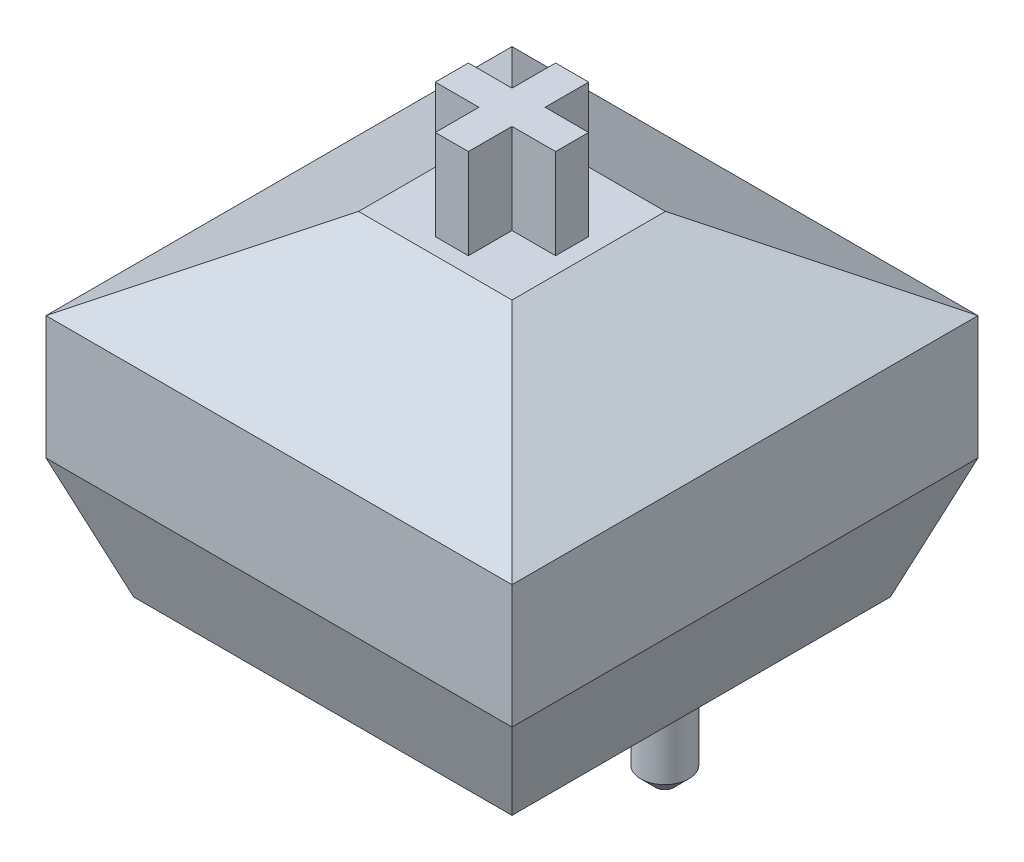
ISO-10303-21;
HEADER;
FILE_DESCRIPTION(('STEP AP214'),'2;1');
FILE_NAME('part.step','',(''),(''),'','','');
FILE_SCHEMA(('AUTOMOTIVE_DESIGN { 1 0 10303 214 1 1 1 1 }'));
ENDSEC;
DATA;
#1=APPLICATION_CONTEXT('core data for automotive mechanical design processes');
#2=APPLICATION_PROTOCOL_DEFINITION('international standard','automotive_design',2000,#1);
#3=PRODUCT_CONTEXT('',#1,'mechanical');
#4=PRODUCT('Part','Part','',(#3));
#5=PRODUCT_RELATED_PRODUCT_CATEGORY('part','',(#4));
#6=PRODUCT_DEFINITION_FORMATION('','',#4);
#7=PRODUCT_DEFINITION_CONTEXT('part definition',#1,'design');
#8=PRODUCT_DEFINITION('design','',#6,#7);
#9=PRODUCT_DEFINITION_SHAPE('','',#8);
#10=(LENGTH_UNIT() NAMED_UNIT(*) SI_UNIT(.MILLI.,.METRE.));
#11=(NAMED_UNIT(*) PLANE_ANGLE_UNIT() SI_UNIT($,.RADIAN.));
#12=(NAMED_UNIT(*) SI_UNIT($,.STERADIAN.) SOLID_ANGLE_UNIT());
#13=UNCERTAINTY_MEASURE_WITH_UNIT(LENGTH_MEASURE(1.E-05),#10,'distance_accuracy_value','');
#14=(GEOMETRIC_REPRESENTATION_CONTEXT(3) GLOBAL_UNCERTAINTY_ASSIGNED_CONTEXT((#13)) GLOBAL_UNIT_ASSIGNED_CONTEXT((#10,
#11,#12)) REPRESENTATION_CONTEXT('',''));
#15=CARTESIAN_POINT('',(0.,0.,0.));
#16=DIRECTION('',(0.,0.,1.));
#17=DIRECTION('',(1.,0.,0.));
#18=AXIS2_PLACEMENT_3D('',#15,#16,#17);
#19=CARTESIAN_POINT('',(0.,11.1,0.));
#20=DIRECTION('',(0.,1.,0.));
#21=DIRECTION('',(0.,0.,1.));
#22=AXIS2_PLACEMENT_3D('',#19,#20,#21);
#23=PLANE('',#22);
#24=DIRECTION('',(0.,0.,-1.));
#25=VECTOR('',#24,1.);
#26=CARTESIAN_POINT('',(2.55084757729337,11.1,-7.747));
#27=LINE('',#26,#25);
#28=CARTESIAN_POINT('',(2.55084757729337,11.1,2.55084757729337));
#29=VERTEX_POINT('',#28);
#30=CARTESIAN_POINT('',(2.55084757729337,11.1,-2.55084757729337));
#31=VERTEX_POINT('',#30);
#32=EDGE_CURVE('E240',#29,#31,#27,.T.);
#33=ORIENTED_EDGE('',*,*,#32,.T.);
#34=DIRECTION('',(-1.,0.,0.));
#35=VECTOR('',#34,1.);
#36=CARTESIAN_POINT('',(-7.747,11.1,-2.55084757729337));
#37=LINE('',#36,#35);
#38=CARTESIAN_POINT('',(-2.55084757729338,11.1,-2.55084757729337));
#39=VERTEX_POINT('',#38);
#40=EDGE_CURVE('E242',#31,#39,#37,.T.);
#41=ORIENTED_EDGE('',*,*,#40,.T.);
#42=DIRECTION('',(0.,0.,1.));
#43=VECTOR('',#42,1.);
#44=CARTESIAN_POINT('',(-2.55084757729338,11.1,7.747));
#45=LINE('',#44,#43);
#46=CARTESIAN_POINT('',(-2.55084757729338,11.1,2.55084757729337));
#47=VERTEX_POINT('',#46);
#48=EDGE_CURVE('E236',#39,#47,#45,.T.);
#49=ORIENTED_EDGE('',*,*,#48,.T.);
#50=DIRECTION('',(1.,0.,0.));
#51=VECTOR('',#50,1.);
#52=CARTESIAN_POINT('',(7.747,11.1,2.55084757729337));
#53=LINE('',#52,#51);
#54=EDGE_CURVE('E238',#47,#29,#53,.T.);
#55=ORIENTED_EDGE('',*,*,#54,.T.);
#56=EDGE_LOOP('',(#33,#41,#49,#55));
#57=FACE_BOUND('',#56,.T.);
#58=DIRECTION('',(1.,0.,0.));
#59=VECTOR('',#58,1.);
#60=CARTESIAN_POINT('',(2.,11.1,0.55));
#61=LINE('',#60,#59);
#62=CARTESIAN_POINT('',(0.55,11.1,0.55));
#63=VERTEX_POINT('',#62);
#64=CARTESIAN_POINT('',(2.,11.1,0.55));
#65=VERTEX_POINT('',#64);
#66=EDGE_CURVE('E756',#63,#65,#61,.T.);
#67=ORIENTED_EDGE('',*,*,#66,.F.);
#68=DIRECTION('',(0.,0.,-1.));
#69=VECTOR('',#68,1.);
#70=CARTESIAN_POINT('',(0.55,11.1,0.55));
#71=LINE('',#70,#69);
#72=CARTESIAN_POINT('',(0.55,11.1,2.));
#73=VERTEX_POINT('',#72);
#74=EDGE_CURVE('E199',#73,#63,#71,.T.);
#75=ORIENTED_EDGE('',*,*,#74,.F.);
#76=DIRECTION('',(1.,0.,0.));
#77=VECTOR('',#76,1.);
#78=CARTESIAN_POINT('',(-0.55,11.1,2.));
#79=LINE('',#78,#77);
#80=CARTESIAN_POINT('',(-0.55,11.1,2.));
#81=VERTEX_POINT('',#80);
#82=EDGE_CURVE('E195',#81,#73,#79,.T.);
#83=ORIENTED_EDGE('',*,*,#82,.F.);
#84=DIRECTION('',(0.,0.,1.));
#85=VECTOR('',#84,1.);
#86=CARTESIAN_POINT('',(-0.55,11.1,0.55));
#87=LINE('',#86,#85);
#88=CARTESIAN_POINT('',(-0.55,11.1,0.55));
#89=VERTEX_POINT('',#88);
#90=EDGE_CURVE('E779',#89,#81,#87,.T.);
#91=ORIENTED_EDGE('',*,*,#90,.F.);
#92=DIRECTION('',(1.,0.,0.));
#93=VECTOR('',#92,1.);
#94=CARTESIAN_POINT('',(-0.55,11.1,0.55));
#95=LINE('',#94,#93);
#96=CARTESIAN_POINT('',(-2.,11.1,0.55));
#97=VERTEX_POINT('',#96);
#98=EDGE_CURVE('E777',#97,#89,#95,.T.);
#99=ORIENTED_EDGE('',*,*,#98,.F.);
#100=DIRECTION('',(0.,0.,1.));
#101=VECTOR('',#100,1.);
#102=CARTESIAN_POINT('',(-2.,11.1,-0.55));
#103=LINE('',#102,#101);
#104=CARTESIAN_POINT('',(-2.,11.1,-0.55));
#105=VERTEX_POINT('',#104);
#106=EDGE_CURVE('E775',#105,#97,#103,.T.);
#107=ORIENTED_EDGE('',*,*,#106,.F.);
#108=DIRECTION('',(-1.,0.,0.));
#109=VECTOR('',#108,1.);
#110=CARTESIAN_POINT('',(-0.55,11.1,-0.55));
#111=LINE('',#110,#109);
#112=CARTESIAN_POINT('',(-0.55,11.1,-0.55));
#113=VERTEX_POINT('',#112);
#114=EDGE_CURVE('E773',#113,#105,#111,.T.);
#115=ORIENTED_EDGE('',*,*,#114,.F.);
#116=DIRECTION('',(0.,0.,1.));
#117=VECTOR('',#116,1.);
#118=CARTESIAN_POINT('',(-0.55,11.1,-2.));
#119=LINE('',#118,#117);
#120=CARTESIAN_POINT('',(-0.55,11.1,-2.));
#121=VERTEX_POINT('',#120);
#122=EDGE_CURVE('E771',#121,#113,#119,.T.);
#123=ORIENTED_EDGE('',*,*,#122,.F.);
#124=DIRECTION('',(-1.,0.,0.));
#125=VECTOR('',#124,1.);
#126=CARTESIAN_POINT('',(-0.55,11.1,-2.));
#127=LINE('',#126,#125);
#128=CARTESIAN_POINT('',(0.55,11.1,-2.));
#129=VERTEX_POINT('',#128);
#130=EDGE_CURVE('E766',#129,#121,#127,.T.);
#131=ORIENTED_EDGE('',*,*,#130,.F.);
#132=DIRECTION('',(0.,0.,-1.));
#133=VECTOR('',#132,1.);
#134=CARTESIAN_POINT('',(0.55,11.1,-2.));
#135=LINE('',#134,#133);
#136=CARTESIAN_POINT('',(0.55,11.1,-0.55));
#137=VERTEX_POINT('',#136);
#138=EDGE_CURVE('E764',#137,#129,#135,.T.);
#139=ORIENTED_EDGE('',*,*,#138,.F.);
#140=DIRECTION('',(-1.,0.,0.));
#141=VECTOR('',#140,1.);
#142=CARTESIAN_POINT('',(2.,11.1,-0.55));
#143=LINE('',#142,#141);
#144=CARTESIAN_POINT('',(2.,11.1,-0.55));
#145=VERTEX_POINT('',#144);
#146=EDGE_CURVE('E755',#145,#137,#143,.T.);
#147=ORIENTED_EDGE('',*,*,#146,.F.);
#148=DIRECTION('',(0.,0.,-1.));
#149=VECTOR('',#148,1.);
#150=CARTESIAN_POINT('',(2.,11.1,-0.55));
#151=LINE('',#150,#149);
#152=EDGE_CURVE('E751',#65,#145,#151,.T.);
#153=ORIENTED_EDGE('',*,*,#152,.F.);
#154=EDGE_LOOP('',(#67,#75,#83,#91,#99,#107,#115,#123,#131,#139,#147,#153));
#155=FACE_BOUND('',#154,.T.);
#156=ADVANCED_FACE('F35',(#57,#155),#23,.T.);
#157=CARTESIAN_POINT('',(0.,-2.8,0.));
#158=DIRECTION('',(0.,1.,0.));
#159=DIRECTION('',(0.,0.,1.));
#160=AXIS2_PLACEMENT_3D('',#157,#158,#159);
#161=CYLINDRICAL_SURFACE('',#160,1.9);
#162=CARTESIAN_POINT('',(0.,-2.3,0.));
#163=DIRECTION('',(0.,1.,0.));
#164=DIRECTION('',(0.,0.,1.));
#165=AXIS2_PLACEMENT_3D('',#162,#163,#164);
#166=CIRCLE('',#165,1.9);
#167=CARTESIAN_POINT('',(0.,-2.3,1.9));
#168=VERTEX_POINT('',#167);
#169=EDGE_CURVE('E281',#168,#168,#166,.T.);
#170=ORIENTED_EDGE('',*,*,#169,.T.);
#171=EDGE_LOOP('',(#170));
#172=FACE_BOUND('',#171,.T.);
#173=CARTESIAN_POINT('',(0.,0.,0.));
#174=DIRECTION('',(0.,1.,0.));
#175=DIRECTION('',(0.,0.,1.));
#176=AXIS2_PLACEMENT_3D('',#173,#174,#175);
#177=CIRCLE('',#176,1.9);
#178=CARTESIAN_POINT('',(0.,0.,1.9));
#179=VERTEX_POINT('',#178);
#180=EDGE_CURVE('E233',#179,#179,#177,.T.);
#181=ORIENTED_EDGE('',*,*,#180,.F.);
#182=EDGE_LOOP('',(#181));
#183=FACE_BOUND('',#182,.T.);
#184=ADVANCED_FACE('F317',(#172,#183),#161,.T.);
#185=CARTESIAN_POINT('',(0.,-2.8,0.));
#186=DIRECTION('',(0.,1.,0.));
#187=DIRECTION('',(0.,0.,1.));
#188=AXIS2_PLACEMENT_3D('',#185,#186,#187);
#189=PLANE('',#188);
#190=CARTESIAN_POINT('',(0.,-2.8,0.));
#191=DIRECTION('',(0.,1.,0.));
#192=DIRECTION('',(0.,0.,1.));
#193=AXIS2_PLACEMENT_3D('',#190,#191,#192);
#194=CIRCLE('',#193,1.39999999999999);
#195=CARTESIAN_POINT('',(0.,-2.8,1.39999999999999));
#196=VERTEX_POINT('',#195);
#197=EDGE_CURVE('E293',#196,#196,#194,.F.);
#198=ORIENTED_EDGE('',*,*,#197,.T.);
#199=EDGE_LOOP('',(#198));
#200=FACE_BOUND('',#199,.T.);
#201=ADVANCED_FACE('F323',(#200),#189,.F.);
#202=CARTESIAN_POINT('',(-7.747,11.1,7.747));
#203=DIRECTION('',(1.,0.,0.));
#204=DIRECTION('',(0.,0.,-1.));
#205=AXIS2_PLACEMENT_3D('',#202,#203,#204);
#206=PLANE('',#205);
#207=DIRECTION('',(0.,-1.,0.));
#208=VECTOR('',#207,1.);
#209=CARTESIAN_POINT('',(-7.747,11.1,-7.747));
#210=LINE('',#209,#208);
#211=CARTESIAN_POINT('',(-7.747,8.09999999999999,-7.747));
#212=VERTEX_POINT('',#211);
#213=CARTESIAN_POINT('',(-7.747,4.00000000000003,-7.747));
#214=VERTEX_POINT('',#213);
#215=EDGE_CURVE('E224',#212,#214,#210,.T.);
#216=ORIENTED_EDGE('',*,*,#215,.T.);
#217=DIRECTION('',(0.,0.,1.));
#218=VECTOR('',#217,1.);
#219=CARTESIAN_POINT('',(-7.747,4.00000000000003,7.747));
#220=LINE('',#219,#218);
#221=CARTESIAN_POINT('',(-7.747,4.00000000000003,7.747));
#222=VERTEX_POINT('',#221);
#223=EDGE_CURVE('E254',#214,#222,#220,.T.);
#224=ORIENTED_EDGE('',*,*,#223,.T.);
#225=DIRECTION('',(0.,-1.,0.));
#226=VECTOR('',#225,1.);
#227=CARTESIAN_POINT('',(-7.747,11.1,7.747));
#228=LINE('',#227,#226);
#229=CARTESIAN_POINT('',(-7.747,8.09999999999999,7.747));
#230=VERTEX_POINT('',#229);
#231=EDGE_CURVE('E231',#230,#222,#228,.T.);
#232=ORIENTED_EDGE('',*,*,#231,.F.);
#233=DIRECTION('',(0.,0.,-1.));
#234=VECTOR('',#233,1.);
#235=CARTESIAN_POINT('',(-7.747,8.09999999999999,-7.747));
#236=LINE('',#235,#234);
#237=EDGE_CURVE('E252',#230,#212,#236,.T.);
#238=ORIENTED_EDGE('',*,*,#237,.T.);
#239=EDGE_LOOP('',(#216,#224,#232,#238));
#240=FACE_BOUND('',#239,.T.);
#241=ADVANCED_FACE('F344',(#240),#206,.F.);
#242=CARTESIAN_POINT('',(7.747,11.1,7.747));
#243=DIRECTION('',(0.,0.,-1.));
#244=DIRECTION('',(-1.,0.,0.));
#245=AXIS2_PLACEMENT_3D('',#242,#243,#244);
#246=PLANE('',#245);
#247=ORIENTED_EDGE('',*,*,#231,.T.);
#248=DIRECTION('',(1.,0.,0.));
#249=VECTOR('',#248,1.);
#250=CARTESIAN_POINT('',(7.747,4.00000000000003,7.747));
#251=LINE('',#250,#249);
#252=CARTESIAN_POINT('',(7.747,4.00000000000003,7.747));
#253=VERTEX_POINT('',#252);
#254=EDGE_CURVE('E59',#222,#253,#251,.T.);
#255=ORIENTED_EDGE('',*,*,#254,.T.);
#256=DIRECTION('',(0.,-1.,0.));
#257=VECTOR('',#256,1.);
#258=CARTESIAN_POINT('',(7.747,11.1,7.747));
#259=LINE('',#258,#257);
#260=CARTESIAN_POINT('',(7.747,8.09999999999999,7.747));
#261=VERTEX_POINT('',#260);
#262=EDGE_CURVE('E229',#261,#253,#259,.T.);
#263=ORIENTED_EDGE('',*,*,#262,.F.);
#264=DIRECTION('',(-1.,0.,0.));
#265=VECTOR('',#264,1.);
#266=CARTESIAN_POINT('',(-7.747,8.09999999999999,7.747));
#267=LINE('',#266,#265);
#268=EDGE_CURVE('E250',#261,#230,#267,.T.);
#269=ORIENTED_EDGE('',*,*,#268,.T.);
#270=EDGE_LOOP('',(#247,#255,#263,#269));
#271=FACE_BOUND('',#270,.T.);
#272=ADVANCED_FACE('F341',(#271),#246,.F.);
#273=CARTESIAN_POINT('',(7.747,11.1,7.747));
#274=DIRECTION('',(-1.,0.,0.));
#275=DIRECTION('',(0.,0.,1.));
#276=AXIS2_PLACEMENT_3D('',#273,#274,#275);
#277=PLANE('',#276);
#278=ORIENTED_EDGE('',*,*,#262,.T.);
#279=DIRECTION('',(0.,0.,-1.));
#280=VECTOR('',#279,1.);
#281=CARTESIAN_POINT('',(7.747,4.00000000000003,7.747));
#282=LINE('',#281,#280);
#283=CARTESIAN_POINT('',(7.747,4.00000000000003,-7.747));
#284=VERTEX_POINT('',#283);
#285=EDGE_CURVE('E51',#253,#284,#282,.T.);
#286=ORIENTED_EDGE('',*,*,#285,.T.);
#287=DIRECTION('',(0.,-1.,0.));
#288=VECTOR('',#287,1.);
#289=CARTESIAN_POINT('',(7.747,11.1,-7.747));
#290=LINE('',#289,#288);
#291=CARTESIAN_POINT('',(7.747,8.09999999999999,-7.747));
#292=VERTEX_POINT('',#291);
#293=EDGE_CURVE('E227',#292,#284,#290,.T.);
#294=ORIENTED_EDGE('',*,*,#293,.F.);
#295=DIRECTION('',(0.,0.,1.));
#296=VECTOR('',#295,1.);
#297=CARTESIAN_POINT('',(7.747,8.09999999999999,7.747));
#298=LINE('',#297,#296);
#299=EDGE_CURVE('E248',#292,#261,#298,.T.);
#300=ORIENTED_EDGE('',*,*,#299,.T.);
#301=EDGE_LOOP('',(#278,#286,#294,#300));
#302=FACE_BOUND('',#301,.T.);
#303=ADVANCED_FACE('F337',(#302),#277,.F.);
#304=CARTESIAN_POINT('',(7.747,11.1,-7.747));
#305=DIRECTION('',(0.,0.,1.));
#306=DIRECTION('',(1.,0.,0.));
#307=AXIS2_PLACEMENT_3D('',#304,#305,#306);
#308=PLANE('',#307);
#309=ORIENTED_EDGE('',*,*,#293,.T.);
#310=DIRECTION('',(-1.,0.,0.));
#311=VECTOR('',#310,1.);
#312=CARTESIAN_POINT('',(7.747,4.00000000000003,-7.747));
#313=LINE('',#312,#311);
#314=EDGE_CURVE('E279',#284,#214,#313,.T.);
#315=ORIENTED_EDGE('',*,*,#314,.T.);
#316=ORIENTED_EDGE('',*,*,#215,.F.);
#317=DIRECTION('',(1.,0.,0.));
#318=VECTOR('',#317,1.);
#319=CARTESIAN_POINT('',(7.747,8.09999999999999,-7.747));
#320=LINE('',#319,#318);
#321=EDGE_CURVE('E245',#212,#292,#320,.T.);
#322=ORIENTED_EDGE('',*,*,#321,.T.);
#323=EDGE_LOOP('',(#309,#315,#316,#322));
#324=FACE_BOUND('',#323,.T.);
#325=ADVANCED_FACE('F333',(#324),#308,.F.);
#326=CARTESIAN_POINT('',(0.,0.,0.));
#327=DIRECTION('',(0.,1.,0.));
#328=DIRECTION('',(0.,0.,1.));
#329=AXIS2_PLACEMENT_3D('',#326,#327,#328);
#330=PLANE('',#329);
#331=DIRECTION('',(-1.,0.,0.));
#332=VECTOR('',#331,1.);
#333=CARTESIAN_POINT('',(0.,0.,6.29111906293519));
#334=LINE('',#333,#332);
#335=CARTESIAN_POINT('',(6.29111906293519,0.,6.29111906293519));
#336=VERTEX_POINT('',#335);
#337=CARTESIAN_POINT('',(-6.29111906293519,0.,6.29111906293519));
#338=VERTEX_POINT('',#337);
#339=EDGE_CURVE('E272',#336,#338,#334,.T.);
#340=ORIENTED_EDGE('',*,*,#339,.T.);
#341=DIRECTION('',(0.,0.,-1.));
#342=VECTOR('',#341,1.);
#343=CARTESIAN_POINT('',(-6.29111906293519,0.,0.));
#344=LINE('',#343,#342);
#345=CARTESIAN_POINT('',(-6.29111906293519,0.,-6.29111906293519));
#346=VERTEX_POINT('',#345);
#347=EDGE_CURVE('E274',#338,#346,#344,.T.);
#348=ORIENTED_EDGE('',*,*,#347,.T.);
#349=DIRECTION('',(1.,0.,0.));
#350=VECTOR('',#349,1.);
#351=CARTESIAN_POINT('',(0.,0.,-6.29111906293519));
#352=LINE('',#351,#350);
#353=CARTESIAN_POINT('',(6.29111906293519,0.,-6.29111906293519));
#354=VERTEX_POINT('',#353);
#355=EDGE_CURVE('E268',#346,#354,#352,.T.);
#356=ORIENTED_EDGE('',*,*,#355,.T.);
#357=DIRECTION('',(0.,0.,1.));
#358=VECTOR('',#357,1.);
#359=CARTESIAN_POINT('',(6.29111906293519,0.,0.));
#360=LINE('',#359,#358);
#361=EDGE_CURVE('E270',#354,#336,#360,.T.);
#362=ORIENTED_EDGE('',*,*,#361,.T.);
#363=EDGE_LOOP('',(#340,#348,#356,#362));
#364=FACE_BOUND('',#363,.T.);
#365=CARTESIAN_POINT('',(2.54,0.,-5.08));
#366=DIRECTION('',(0.,1.,0.));
#367=DIRECTION('',(0.,0.,1.));
#368=AXIS2_PLACEMENT_3D('',#365,#366,#367);
#369=CIRCLE('',#368,0.6);
#370=CARTESIAN_POINT('',(2.54,0.,-4.48));
#371=VERTEX_POINT('',#370);
#372=EDGE_CURVE('E201',#371,#371,#369,.T.);
#373=ORIENTED_EDGE('',*,*,#372,.T.);
#374=EDGE_LOOP('',(#373));
#375=FACE_BOUND('',#374,.T.);
#376=CARTESIAN_POINT('',(-3.81,0.,-2.54));
#377=DIRECTION('',(0.,1.,0.));
#378=DIRECTION('',(0.,0.,1.));
#379=AXIS2_PLACEMENT_3D('',#376,#377,#378);
#380=CIRCLE('',#379,0.6);
#381=CARTESIAN_POINT('',(-3.81,0.,-1.94));
#382=VERTEX_POINT('',#381);
#383=EDGE_CURVE('E211',#382,#382,#380,.T.);
#384=ORIENTED_EDGE('',*,*,#383,.T.);
#385=EDGE_LOOP('',(#384));
#386=FACE_BOUND('',#385,.T.);
#387=CARTESIAN_POINT('',(-5.08,0.,0.));
#388=DIRECTION('',(0.,1.,0.));
#389=DIRECTION('',(0.,0.,1.));
#390=AXIS2_PLACEMENT_3D('',#387,#388,#389);
#391=CIRCLE('',#390,0.8);
#392=CARTESIAN_POINT('',(-5.08,0.,0.8));
#393=VERTEX_POINT('',#392);
#394=EDGE_CURVE('E216',#393,#393,#391,.T.);
#395=ORIENTED_EDGE('',*,*,#394,.T.);
#396=EDGE_LOOP('',(#395));
#397=FACE_BOUND('',#396,.T.);
#398=CARTESIAN_POINT('',(5.08,0.,0.));
#399=DIRECTION('',(0.,1.,0.));
#400=DIRECTION('',(0.,0.,1.));
#401=AXIS2_PLACEMENT_3D('',#398,#399,#400);
#402=CIRCLE('',#401,0.800000000000001);
#403=CARTESIAN_POINT('',(5.08,0.,0.800000000000001));
#404=VERTEX_POINT('',#403);
#405=EDGE_CURVE('E221',#404,#404,#402,.T.);
#406=ORIENTED_EDGE('',*,*,#405,.T.);
#407=EDGE_LOOP('',(#406));
#408=FACE_BOUND('',#407,.T.);
#409=ORIENTED_EDGE('',*,*,#180,.T.);
#410=EDGE_LOOP('',(#409));
#411=FACE_BOUND('',#410,.T.);
#412=ADVANCED_FACE('F330',(#364,#375,#386,#397,#408,#411),#330,.F.);
#413=CARTESIAN_POINT('',(5.08,-2.8,0.));
#414=DIRECTION('',(0.,1.,0.));
#415=DIRECTION('',(0.,0.,1.));
#416=AXIS2_PLACEMENT_3D('',#413,#414,#415);
#417=CYLINDRICAL_SURFACE('',#416,0.800000000000001);
#418=CARTESIAN_POINT('',(5.08,-2.3,0.));
#419=DIRECTION('',(0.,1.,0.));
#420=DIRECTION('',(0.,0.,1.));
#421=AXIS2_PLACEMENT_3D('',#418,#419,#420);
#422=CIRCLE('',#421,0.800000000000001);
#423=CARTESIAN_POINT('',(5.08,-2.3,0.800000000000001));
#424=VERTEX_POINT('',#423);
#425=EDGE_CURVE('E44',#424,#424,#422,.T.);
#426=ORIENTED_EDGE('',*,*,#425,.T.);
#427=EDGE_LOOP('',(#426));
#428=FACE_BOUND('',#427,.T.);
#429=ORIENTED_EDGE('',*,*,#405,.F.);
#430=EDGE_LOOP('',(#429));
#431=FACE_BOUND('',#430,.T.);
#432=ADVANCED_FACE('F304',(#428,#431),#417,.T.);
#433=CARTESIAN_POINT('',(5.08,-2.8,0.));
#434=DIRECTION('',(0.,1.,0.));
#435=DIRECTION('',(0.,0.,1.));
#436=AXIS2_PLACEMENT_3D('',#433,#434,#435);
#437=PLANE('',#436);
#438=CARTESIAN_POINT('',(5.08,-2.8,0.));
#439=DIRECTION('',(0.,1.,0.));
#440=DIRECTION('',(0.,0.,1.));
#441=AXIS2_PLACEMENT_3D('',#438,#439,#440);
#442=CIRCLE('',#441,0.299999999999992);
#443=CARTESIAN_POINT('',(5.08,-2.8,0.299999999999992));
#444=VERTEX_POINT('',#443);
#445=EDGE_CURVE('E11',#444,#444,#442,.F.);
#446=ORIENTED_EDGE('',*,*,#445,.T.);
#447=EDGE_LOOP('',(#446));
#448=FACE_BOUND('',#447,.T.);
#449=ADVANCED_FACE('F673',(#448),#437,.F.);
#450=CARTESIAN_POINT('',(-5.08,-2.8,0.));
#451=DIRECTION('',(0.,1.,0.));
#452=DIRECTION('',(0.,0.,1.));
#453=AXIS2_PLACEMENT_3D('',#450,#451,#452);
#454=CYLINDRICAL_SURFACE('',#453,0.8);
#455=CARTESIAN_POINT('',(-5.08,-2.3,0.));
#456=DIRECTION('',(0.,1.,0.));
#457=DIRECTION('',(0.,0.,1.));
#458=AXIS2_PLACEMENT_3D('',#455,#456,#457);
#459=CIRCLE('',#458,0.8);
#460=CARTESIAN_POINT('',(-5.08,-2.3,0.8));
#461=VERTEX_POINT('',#460);
#462=EDGE_CURVE('E296',#461,#461,#459,.T.);
#463=ORIENTED_EDGE('',*,*,#462,.T.);
#464=EDGE_LOOP('',(#463));
#465=FACE_BOUND('',#464,.T.);
#466=ORIENTED_EDGE('',*,*,#394,.F.);
#467=EDGE_LOOP('',(#466));
#468=FACE_BOUND('',#467,.T.);
#469=ADVANCED_FACE('F664',(#465,#468),#454,.T.);
#470=CARTESIAN_POINT('',(-5.08,-2.8,0.));
#471=DIRECTION('',(0.,1.,0.));
#472=DIRECTION('',(0.,0.,1.));
#473=AXIS2_PLACEMENT_3D('',#470,#471,#472);
#474=PLANE('',#473);
#475=CARTESIAN_POINT('',(-5.08,-2.8,0.));
#476=DIRECTION('',(0.,1.,0.));
#477=DIRECTION('',(0.,0.,1.));
#478=AXIS2_PLACEMENT_3D('',#475,#476,#477);
#479=CIRCLE('',#478,0.299999999999991);
#480=CARTESIAN_POINT('',(-5.08,-2.8,0.299999999999991));
#481=VERTEX_POINT('',#480);
#482=EDGE_CURVE('E299',#481,#481,#479,.F.);
#483=ORIENTED_EDGE('',*,*,#482,.T.);
#484=EDGE_LOOP('',(#483));
#485=FACE_BOUND('',#484,.T.);
#486=ADVANCED_FACE('F656',(#485),#474,.F.);
#487=CARTESIAN_POINT('',(-3.81,-2.8,-2.54));
#488=DIRECTION('',(0.,1.,0.));
#489=DIRECTION('',(0.,0.,1.));
#490=AXIS2_PLACEMENT_3D('',#487,#488,#489);
#491=CYLINDRICAL_SURFACE('',#490,0.6);
#492=CARTESIAN_POINT('',(-3.81,-2.8,-2.54));
#493=DIRECTION('',(0.,1.,0.));
#494=DIRECTION('',(0.,0.,1.));
#495=AXIS2_PLACEMENT_3D('',#492,#493,#494);
#496=CIRCLE('',#495,0.6);
#497=CARTESIAN_POINT('',(-3.81,-2.8,-1.94));
#498=VERTEX_POINT('',#497);
#499=EDGE_CURVE('E213',#498,#498,#496,.T.);
#500=ORIENTED_EDGE('',*,*,#499,.T.);
#501=EDGE_LOOP('',(#500));
#502=FACE_BOUND('',#501,.T.);
#503=ORIENTED_EDGE('',*,*,#383,.F.);
#504=EDGE_LOOP('',(#503));
#505=FACE_BOUND('',#504,.T.);
#506=ADVANCED_FACE('F647',(#502,#505),#491,.T.);
#507=CARTESIAN_POINT('',(-3.81,-2.8,-2.54));
#508=DIRECTION('',(0.,1.,0.));
#509=DIRECTION('',(0.,0.,1.));
#510=AXIS2_PLACEMENT_3D('',#507,#508,#509);
#511=PLANE('',#510);
#512=ORIENTED_EDGE('',*,*,#499,.F.);
#513=EDGE_LOOP('',(#512));
#514=FACE_BOUND('',#513,.T.);
#515=ADVANCED_FACE('F638',(#514),#511,.F.);
#516=CARTESIAN_POINT('',(2.54,-2.8,-5.08));
#517=DIRECTION('',(0.,1.,0.));
#518=DIRECTION('',(0.,0.,1.));
#519=AXIS2_PLACEMENT_3D('',#516,#517,#518);
#520=CYLINDRICAL_SURFACE('',#519,0.6);
#521=CARTESIAN_POINT('',(2.54,-2.8,-5.08));
#522=DIRECTION('',(0.,1.,0.));
#523=DIRECTION('',(0.,0.,1.));
#524=AXIS2_PLACEMENT_3D('',#521,#522,#523);
#525=CIRCLE('',#524,0.6);
#526=CARTESIAN_POINT('',(2.54,-2.8,-4.48));
#527=VERTEX_POINT('',#526);
#528=EDGE_CURVE('E204',#527,#527,#525,.T.);
#529=ORIENTED_EDGE('',*,*,#528,.T.);
#530=EDGE_LOOP('',(#529));
#531=FACE_BOUND('',#530,.T.);
#532=ORIENTED_EDGE('',*,*,#372,.F.);
#533=EDGE_LOOP('',(#532));
#534=FACE_BOUND('',#533,.T.);
#535=ADVANCED_FACE('F629',(#531,#534),#520,.T.);
#536=CARTESIAN_POINT('',(2.54,-2.8,-5.08));
#537=DIRECTION('',(0.,1.,0.));
#538=DIRECTION('',(0.,0.,1.));
#539=AXIS2_PLACEMENT_3D('',#536,#537,#538);
#540=PLANE('',#539);
#541=ORIENTED_EDGE('',*,*,#528,.F.);
#542=EDGE_LOOP('',(#541));
#543=FACE_BOUND('',#542,.T.);
#544=ADVANCED_FACE('F594',(#543),#540,.F.);
#545=CARTESIAN_POINT('',(0.55,14.1,0.55));
#546=DIRECTION('',(-1.,0.,0.));
#547=DIRECTION('',(0.,0.,1.));
#548=AXIS2_PLACEMENT_3D('',#545,#546,#547);
#549=PLANE('',#548);
#550=ORIENTED_EDGE('',*,*,#74,.T.);
#551=DIRECTION('',(0.,-1.,0.));
#552=VECTOR('',#551,1.);
#553=CARTESIAN_POINT('',(0.55,14.1,0.55));
#554=LINE('',#553,#552);
#555=CARTESIAN_POINT('',(0.55,14.1,0.55));
#556=VERTEX_POINT('',#555);
#557=EDGE_CURVE('E179',#556,#63,#554,.T.);
#558=ORIENTED_EDGE('',*,*,#557,.F.);
#559=DIRECTION('',(0.,0.,-1.));
#560=VECTOR('',#559,1.);
#561=CARTESIAN_POINT('',(0.55,14.1,0.55));
#562=LINE('',#561,#560);
#563=CARTESIAN_POINT('',(0.55,14.1,2.));
#564=VERTEX_POINT('',#563);
#565=EDGE_CURVE('E186',#564,#556,#562,.T.);
#566=ORIENTED_EDGE('',*,*,#565,.F.);
#567=DIRECTION('',(0.,-1.,0.));
#568=VECTOR('',#567,1.);
#569=CARTESIAN_POINT('',(0.55,14.1,2.));
#570=LINE('',#569,#568);
#571=EDGE_CURVE('E783',#564,#73,#570,.T.);
#572=ORIENTED_EDGE('',*,*,#571,.T.);
#573=EDGE_LOOP('',(#550,#558,#566,#572));
#574=FACE_BOUND('',#573,.T.);
#575=ADVANCED_FACE('F197',(#574),#549,.F.);
#576=CARTESIAN_POINT('',(2.,14.1,0.55));
#577=DIRECTION('',(0.,0.,-1.));
#578=DIRECTION('',(-1.,0.,0.));
#579=AXIS2_PLACEMENT_3D('',#576,#577,#578);
#580=PLANE('',#579);
#581=ORIENTED_EDGE('',*,*,#66,.T.);
#582=DIRECTION('',(0.,-1.,0.));
#583=VECTOR('',#582,1.);
#584=CARTESIAN_POINT('',(2.,14.1,0.55));
#585=LINE('',#584,#583);
#586=CARTESIAN_POINT('',(2.,14.1,0.55));
#587=VERTEX_POINT('',#586);
#588=EDGE_CURVE('E182',#587,#65,#585,.T.);
#589=ORIENTED_EDGE('',*,*,#588,.F.);
#590=DIRECTION('',(1.,0.,0.));
#591=VECTOR('',#590,1.);
#592=CARTESIAN_POINT('',(2.,14.1,0.55));
#593=LINE('',#592,#591);
#594=EDGE_CURVE('E175',#556,#587,#593,.T.);
#595=ORIENTED_EDGE('',*,*,#594,.F.);
#596=ORIENTED_EDGE('',*,*,#557,.T.);
#597=EDGE_LOOP('',(#581,#589,#595,#596));
#598=FACE_BOUND('',#597,.T.);
#599=ADVANCED_FACE('F177',(#598),#580,.F.);
#600=CARTESIAN_POINT('',(2.,14.1,-0.55));
#601=DIRECTION('',(-1.,0.,0.));
#602=DIRECTION('',(0.,0.,1.));
#603=AXIS2_PLACEMENT_3D('',#600,#601,#602);
#604=PLANE('',#603);
#605=ORIENTED_EDGE('',*,*,#152,.T.);
#606=DIRECTION('',(0.,-1.,0.));
#607=VECTOR('',#606,1.);
#608=CARTESIAN_POINT('',(2.,14.1,-0.55));
#609=LINE('',#608,#607);
#610=CARTESIAN_POINT('',(2.,14.1,-0.55));
#611=VERTEX_POINT('',#610);
#612=EDGE_CURVE('E206',#611,#145,#609,.T.);
#613=ORIENTED_EDGE('',*,*,#612,.F.);
#614=DIRECTION('',(0.,0.,-1.));
#615=VECTOR('',#614,1.);
#616=CARTESIAN_POINT('',(2.,14.1,-0.55));
#617=LINE('',#616,#615);
#618=EDGE_CURVE('E185',#587,#611,#617,.T.);
#619=ORIENTED_EDGE('',*,*,#618,.F.);
#620=ORIENTED_EDGE('',*,*,#588,.T.);
#621=EDGE_LOOP('',(#605,#613,#619,#620));
#622=FACE_BOUND('',#621,.T.);
#623=ADVANCED_FACE('F570',(#622),#604,.F.);
#624=CARTESIAN_POINT('',(2.,14.1,-0.55));
#625=DIRECTION('',(0.,0.,1.));
#626=DIRECTION('',(1.,0.,0.));
#627=AXIS2_PLACEMENT_3D('',#624,#625,#626);
#628=PLANE('',#627);
#629=ORIENTED_EDGE('',*,*,#146,.T.);
#630=DIRECTION('',(0.,-1.,0.));
#631=VECTOR('',#630,1.);
#632=CARTESIAN_POINT('',(0.55,14.1,-0.55));
#633=LINE('',#632,#631);
#634=CARTESIAN_POINT('',(0.55,14.1,-0.55));
#635=VERTEX_POINT('',#634);
#636=EDGE_CURVE('E761',#635,#137,#633,.T.);
#637=ORIENTED_EDGE('',*,*,#636,.F.);
#638=DIRECTION('',(-1.,0.,0.));
#639=VECTOR('',#638,1.);
#640=CARTESIAN_POINT('',(2.,14.1,-0.55));
#641=LINE('',#640,#639);
#642=EDGE_CURVE('E760',#611,#635,#641,.T.);
#643=ORIENTED_EDGE('',*,*,#642,.F.);
#644=ORIENTED_EDGE('',*,*,#612,.T.);
#645=EDGE_LOOP('',(#629,#637,#643,#644));
#646=FACE_BOUND('',#645,.T.);
#647=ADVANCED_FACE('F561',(#646),#628,.F.);
#648=CARTESIAN_POINT('',(0.55,14.1,-2.));
#649=DIRECTION('',(-1.,0.,0.));
#650=DIRECTION('',(0.,0.,1.));
#651=AXIS2_PLACEMENT_3D('',#648,#649,#650);
#652=PLANE('',#651);
#653=ORIENTED_EDGE('',*,*,#138,.T.);
#654=DIRECTION('',(0.,-1.,0.));
#655=VECTOR('',#654,1.);
#656=CARTESIAN_POINT('',(0.55,14.1,-2.));
#657=LINE('',#656,#655);
#658=CARTESIAN_POINT('',(0.55,14.1,-2.));
#659=VERTEX_POINT('',#658);
#660=EDGE_CURVE('E802',#659,#129,#657,.T.);
#661=ORIENTED_EDGE('',*,*,#660,.F.);
#662=DIRECTION('',(0.,0.,-1.));
#663=VECTOR('',#662,1.);
#664=CARTESIAN_POINT('',(0.55,14.1,-2.));
#665=LINE('',#664,#663);
#666=EDGE_CURVE('E807',#635,#659,#665,.T.);
#667=ORIENTED_EDGE('',*,*,#666,.F.);
#668=ORIENTED_EDGE('',*,*,#636,.T.);
#669=EDGE_LOOP('',(#653,#661,#667,#668));
#670=FACE_BOUND('',#669,.T.);
#671=ADVANCED_FACE('F552',(#670),#652,.F.);
#672=CARTESIAN_POINT('',(-0.55,14.1,-2.));
#673=DIRECTION('',(0.,0.,1.));
#674=DIRECTION('',(1.,0.,0.));
#675=AXIS2_PLACEMENT_3D('',#672,#673,#674);
#676=PLANE('',#675);
#677=ORIENTED_EDGE('',*,*,#130,.T.);
#678=DIRECTION('',(0.,-1.,0.));
#679=VECTOR('',#678,1.);
#680=CARTESIAN_POINT('',(-0.55,14.1,-2.));
#681=LINE('',#680,#679);
#682=CARTESIAN_POINT('',(-0.55,14.1,-2.));
#683=VERTEX_POINT('',#682);
#684=EDGE_CURVE('E799',#683,#121,#681,.T.);
#685=ORIENTED_EDGE('',*,*,#684,.F.);
#686=DIRECTION('',(-1.,0.,0.));
#687=VECTOR('',#686,1.);
#688=CARTESIAN_POINT('',(-0.55,14.1,-2.));
#689=LINE('',#688,#687);
#690=EDGE_CURVE('E809',#659,#683,#689,.T.);
#691=ORIENTED_EDGE('',*,*,#690,.F.);
#692=ORIENTED_EDGE('',*,*,#660,.T.);
#693=EDGE_LOOP('',(#677,#685,#691,#692));
#694=FACE_BOUND('',#693,.T.);
#695=ADVANCED_FACE('F543',(#694),#676,.F.);
#696=CARTESIAN_POINT('',(-0.55,14.1,-2.));
#697=DIRECTION('',(1.,0.,0.));
#698=DIRECTION('',(0.,0.,-1.));
#699=AXIS2_PLACEMENT_3D('',#696,#697,#698);
#700=PLANE('',#699);
#701=ORIENTED_EDGE('',*,*,#122,.T.);
#702=DIRECTION('',(0.,-1.,0.));
#703=VECTOR('',#702,1.);
#704=CARTESIAN_POINT('',(-0.55,14.1,-0.55));
#705=LINE('',#704,#703);
#706=CARTESIAN_POINT('',(-0.55,14.1,-0.55));
#707=VERTEX_POINT('',#706);
#708=EDGE_CURVE('E796',#707,#113,#705,.T.);
#709=ORIENTED_EDGE('',*,*,#708,.F.);
#710=DIRECTION('',(0.,0.,1.));
#711=VECTOR('',#710,1.);
#712=CARTESIAN_POINT('',(-0.55,14.1,-2.));
#713=LINE('',#712,#711);
#714=EDGE_CURVE('E811',#683,#707,#713,.T.);
#715=ORIENTED_EDGE('',*,*,#714,.F.);
#716=ORIENTED_EDGE('',*,*,#684,.T.);
#717=EDGE_LOOP('',(#701,#709,#715,#716));
#718=FACE_BOUND('',#717,.T.);
#719=ADVANCED_FACE('F534',(#718),#700,.F.);
#720=CARTESIAN_POINT('',(-0.55,14.1,-0.55));
#721=DIRECTION('',(0.,0.,1.));
#722=DIRECTION('',(1.,0.,0.));
#723=AXIS2_PLACEMENT_3D('',#720,#721,#722);
#724=PLANE('',#723);
#725=ORIENTED_EDGE('',*,*,#114,.T.);
#726=DIRECTION('',(0.,-1.,0.));
#727=VECTOR('',#726,1.);
#728=CARTESIAN_POINT('',(-2.,14.1,-0.55));
#729=LINE('',#728,#727);
#730=CARTESIAN_POINT('',(-2.,14.1,-0.55));
#731=VERTEX_POINT('',#730);
#732=EDGE_CURVE('E793',#731,#105,#729,.T.);
#733=ORIENTED_EDGE('',*,*,#732,.F.);
#734=DIRECTION('',(-1.,0.,0.));
#735=VECTOR('',#734,1.);
#736=CARTESIAN_POINT('',(-0.55,14.1,-0.55));
#737=LINE('',#736,#735);
#738=EDGE_CURVE('E817',#707,#731,#737,.T.);
#739=ORIENTED_EDGE('',*,*,#738,.F.);
#740=ORIENTED_EDGE('',*,*,#708,.T.);
#741=EDGE_LOOP('',(#725,#733,#739,#740));
#742=FACE_BOUND('',#741,.T.);
#743=ADVANCED_FACE('F525',(#742),#724,.F.);
#744=CARTESIAN_POINT('',(-2.,14.1,-0.55));
#745=DIRECTION('',(1.,0.,0.));
#746=DIRECTION('',(0.,0.,-1.));
#747=AXIS2_PLACEMENT_3D('',#744,#745,#746);
#748=PLANE('',#747);
#749=ORIENTED_EDGE('',*,*,#106,.T.);
#750=DIRECTION('',(0.,-1.,0.));
#751=VECTOR('',#750,1.);
#752=CARTESIAN_POINT('',(-2.,14.1,0.55));
#753=LINE('',#752,#751);
#754=CARTESIAN_POINT('',(-2.,14.1,0.55));
#755=VERTEX_POINT('',#754);
#756=EDGE_CURVE('E790',#755,#97,#753,.T.);
#757=ORIENTED_EDGE('',*,*,#756,.F.);
#758=DIRECTION('',(0.,0.,1.));
#759=VECTOR('',#758,1.);
#760=CARTESIAN_POINT('',(-2.,14.1,-0.55));
#761=LINE('',#760,#759);
#762=EDGE_CURVE('E819',#731,#755,#761,.T.);
#763=ORIENTED_EDGE('',*,*,#762,.F.);
#764=ORIENTED_EDGE('',*,*,#732,.T.);
#765=EDGE_LOOP('',(#749,#757,#763,#764));
#766=FACE_BOUND('',#765,.T.);
#767=ADVANCED_FACE('F516',(#766),#748,.F.);
#768=CARTESIAN_POINT('',(-0.55,14.1,0.55));
#769=DIRECTION('',(0.,0.,-1.));
#770=DIRECTION('',(-1.,0.,0.));
#771=AXIS2_PLACEMENT_3D('',#768,#769,#770);
#772=PLANE('',#771);
#773=ORIENTED_EDGE('',*,*,#98,.T.);
#774=DIRECTION('',(0.,-1.,0.));
#775=VECTOR('',#774,1.);
#776=CARTESIAN_POINT('',(-0.55,14.1,0.55));
#777=LINE('',#776,#775);
#778=CARTESIAN_POINT('',(-0.55,14.1,0.55));
#779=VERTEX_POINT('',#778);
#780=EDGE_CURVE('E787',#779,#89,#777,.T.);
#781=ORIENTED_EDGE('',*,*,#780,.F.);
#782=DIRECTION('',(1.,0.,0.));
#783=VECTOR('',#782,1.);
#784=CARTESIAN_POINT('',(-0.55,14.1,0.55));
#785=LINE('',#784,#783);
#786=EDGE_CURVE('E821',#755,#779,#785,.T.);
#787=ORIENTED_EDGE('',*,*,#786,.F.);
#788=ORIENTED_EDGE('',*,*,#756,.T.);
#789=EDGE_LOOP('',(#773,#781,#787,#788));
#790=FACE_BOUND('',#789,.T.);
#791=ADVANCED_FACE('F507',(#790),#772,.F.);
#792=CARTESIAN_POINT('',(-0.55,14.1,0.55));
#793=DIRECTION('',(1.,0.,0.));
#794=DIRECTION('',(0.,0.,-1.));
#795=AXIS2_PLACEMENT_3D('',#792,#793,#794);
#796=PLANE('',#795);
#797=ORIENTED_EDGE('',*,*,#90,.T.);
#798=DIRECTION('',(0.,-1.,0.));
#799=VECTOR('',#798,1.);
#800=CARTESIAN_POINT('',(-0.55,14.1,2.));
#801=LINE('',#800,#799);
#802=CARTESIAN_POINT('',(-0.55,14.1,2.));
#803=VERTEX_POINT('',#802);
#804=EDGE_CURVE('E785',#803,#81,#801,.T.);
#805=ORIENTED_EDGE('',*,*,#804,.F.);
#806=DIRECTION('',(0.,0.,1.));
#807=VECTOR('',#806,1.);
#808=CARTESIAN_POINT('',(-0.55,14.1,0.55));
#809=LINE('',#808,#807);
#810=EDGE_CURVE('E823',#779,#803,#809,.T.);
#811=ORIENTED_EDGE('',*,*,#810,.F.);
#812=ORIENTED_EDGE('',*,*,#780,.T.);
#813=EDGE_LOOP('',(#797,#805,#811,#812));
#814=FACE_BOUND('',#813,.T.);
#815=ADVANCED_FACE('F498',(#814),#796,.F.);
#816=CARTESIAN_POINT('',(-0.55,14.1,2.));
#817=DIRECTION('',(0.,0.,-1.));
#818=DIRECTION('',(-1.,0.,0.));
#819=AXIS2_PLACEMENT_3D('',#816,#817,#818);
#820=PLANE('',#819);
#821=ORIENTED_EDGE('',*,*,#82,.T.);
#822=ORIENTED_EDGE('',*,*,#571,.F.);
#823=DIRECTION('',(1.,0.,0.));
#824=VECTOR('',#823,1.);
#825=CARTESIAN_POINT('',(-0.55,14.1,2.));
#826=LINE('',#825,#824);
#827=EDGE_CURVE('E191',#803,#564,#826,.T.);
#828=ORIENTED_EDGE('',*,*,#827,.F.);
#829=ORIENTED_EDGE('',*,*,#804,.T.);
#830=EDGE_LOOP('',(#821,#822,#828,#829));
#831=FACE_BOUND('',#830,.T.);
#832=ADVANCED_FACE('F490',(#831),#820,.F.);
#833=CARTESIAN_POINT('',(0.,14.1,0.));
#834=DIRECTION('',(0.,1.,0.));
#835=DIRECTION('',(0.,0.,1.));
#836=AXIS2_PLACEMENT_3D('',#833,#834,#835);
#837=PLANE('',#836);
#838=ORIENTED_EDGE('',*,*,#565,.T.);
#839=ORIENTED_EDGE('',*,*,#594,.T.);
#840=ORIENTED_EDGE('',*,*,#618,.T.);
#841=ORIENTED_EDGE('',*,*,#642,.T.);
#842=ORIENTED_EDGE('',*,*,#666,.T.);
#843=ORIENTED_EDGE('',*,*,#690,.T.);
#844=ORIENTED_EDGE('',*,*,#714,.T.);
#845=ORIENTED_EDGE('',*,*,#738,.T.);
#846=ORIENTED_EDGE('',*,*,#762,.T.);
#847=ORIENTED_EDGE('',*,*,#786,.T.);
#848=ORIENTED_EDGE('',*,*,#810,.T.);
#849=ORIENTED_EDGE('',*,*,#827,.T.);
#850=EDGE_LOOP('',(#838,#839,#840,#841,#842,#843,#844,#845,#846,#847,#848,#849));
#851=FACE_BOUND('',#850,.T.);
#852=ADVANCED_FACE('F189',(#851),#837,.T.);
#853=CARTESIAN_POINT('',(0.,11.1,2.55084757729337));
#854=DIRECTION('',(0.,0.866025403784438,0.500000000000001));
#855=DIRECTION('',(-1.,0.,0.));
#856=AXIS2_PLACEMENT_3D('',#853,#854,#855);
#857=PLANE('',#856);
#858=DIRECTION('',(0.654653670707977,0.377964473009228,-0.654653670707977));
#859=VECTOR('',#858,1.);
#860=CARTESIAN_POINT('',(-1.45762718702479,11.7311710866052,1.45762718702479));
#861=LINE('',#860,#859);
#862=EDGE_CURVE('E260',#230,#47,#861,.T.);
#863=ORIENTED_EDGE('',*,*,#862,.F.);
#864=ORIENTED_EDGE('',*,*,#268,.F.);
#865=DIRECTION('',(-0.654653670707977,0.377964473009228,-0.654653670707977));
#866=VECTOR('',#865,1.);
#867=CARTESIAN_POINT('',(1.45762718702479,11.7311710866052,1.45762718702479));
#868=LINE('',#867,#866);
#869=EDGE_CURVE('E263',#29,#261,#868,.F.);
#870=ORIENTED_EDGE('',*,*,#869,.F.);
#871=ORIENTED_EDGE('',*,*,#54,.F.);
#872=EDGE_LOOP('',(#863,#864,#870,#871));
#873=FACE_BOUND('',#872,.T.);
#874=ADVANCED_FACE('F374',(#873),#857,.T.);
#875=CARTESIAN_POINT('',(2.55084757729337,11.1,0.));
#876=DIRECTION('',(0.500000000000001,0.866025403784438,0.));
#877=DIRECTION('',(0.,0.,1.));
#878=AXIS2_PLACEMENT_3D('',#875,#876,#877);
#879=PLANE('',#878);
#880=ORIENTED_EDGE('',*,*,#869,.T.);
#881=ORIENTED_EDGE('',*,*,#299,.F.);
#882=DIRECTION('',(-0.654653670707977,0.377964473009228,0.654653670707977));
#883=VECTOR('',#882,1.);
#884=CARTESIAN_POINT('',(1.45762718702479,11.7311710866052,-1.45762718702479));
#885=LINE('',#884,#883);
#886=EDGE_CURVE('E257',#31,#292,#885,.F.);
#887=ORIENTED_EDGE('',*,*,#886,.F.);
#888=ORIENTED_EDGE('',*,*,#32,.F.);
#889=EDGE_LOOP('',(#880,#881,#887,#888));
#890=FACE_BOUND('',#889,.T.);
#891=ADVANCED_FACE('F367',(#890),#879,.T.);
#892=CARTESIAN_POINT('',(-2.55084757729338,11.1,0.));
#893=DIRECTION('',(-0.500000000000001,0.866025403784438,0.));
#894=DIRECTION('',(0.,0.,-1.));
#895=AXIS2_PLACEMENT_3D('',#892,#893,#894);
#896=PLANE('',#895);
#897=ORIENTED_EDGE('',*,*,#862,.T.);
#898=ORIENTED_EDGE('',*,*,#48,.F.);
#899=DIRECTION('',(-0.654653670707977,-0.377964473009228,-0.654653670707977));
#900=VECTOR('',#899,1.);
#901=CARTESIAN_POINT('',(-1.45762718702479,11.7311710866052,-1.45762718702479));
#902=LINE('',#901,#900);
#903=EDGE_CURVE('E255',#212,#39,#902,.F.);
#904=ORIENTED_EDGE('',*,*,#903,.F.);
#905=ORIENTED_EDGE('',*,*,#237,.F.);
#906=EDGE_LOOP('',(#897,#898,#904,#905));
#907=FACE_BOUND('',#906,.T.);
#908=ADVANCED_FACE('F360',(#907),#896,.T.);
#909=CARTESIAN_POINT('',(0.,11.1,-2.55084757729337));
#910=DIRECTION('',(0.,0.866025403784438,-0.500000000000001));
#911=DIRECTION('',(1.,0.,0.));
#912=AXIS2_PLACEMENT_3D('',#909,#910,#911);
#913=PLANE('',#912);
#914=ORIENTED_EDGE('',*,*,#886,.T.);
#915=ORIENTED_EDGE('',*,*,#321,.F.);
#916=ORIENTED_EDGE('',*,*,#903,.T.);
#917=ORIENTED_EDGE('',*,*,#40,.F.);
#918=EDGE_LOOP('',(#914,#915,#916,#917));
#919=FACE_BOUND('',#918,.T.);
#920=ADVANCED_FACE('F352',(#919),#913,.T.);
#921=CARTESIAN_POINT('',(7.747,4.00000000000003,7.747));
#922=DIRECTION('',(-0.939692620785909,0.342020143325666,0.));
#923=DIRECTION('',(0.,0.,-1.));
#924=AXIS2_PLACEMENT_3D('',#921,#922,#923);
#925=PLANE('',#924);
#926=DIRECTION('',(-0.323615577118183,-0.88912649071599,-0.323615577118182));
#927=VECTOR('',#926,1.);
#928=CARTESIAN_POINT('',(7.747,4.00000000000003,7.747));
#929=LINE('',#928,#927);
#930=EDGE_CURVE('E286',#336,#253,#929,.F.);
#931=ORIENTED_EDGE('',*,*,#930,.F.);
#932=ORIENTED_EDGE('',*,*,#361,.F.);
#933=DIRECTION('',(-0.323615577118182,-0.88912649071599,0.323615577118182));
#934=VECTOR('',#933,1.);
#935=CARTESIAN_POINT('',(7.747,4.00000000000003,-7.747));
#936=LINE('',#935,#934);
#937=EDGE_CURVE('E258',#284,#354,#936,.T.);
#938=ORIENTED_EDGE('',*,*,#937,.F.);
#939=ORIENTED_EDGE('',*,*,#285,.F.);
#940=EDGE_LOOP('',(#931,#932,#938,#939));
#941=FACE_BOUND('',#940,.T.);
#942=ADVANCED_FACE('F359',(#941),#925,.F.);
#943=CARTESIAN_POINT('',(7.747,4.00000000000003,-7.747));
#944=DIRECTION('',(0.,0.342020143325666,0.93969262078591));
#945=DIRECTION('',(-1.,0.,0.));
#946=AXIS2_PLACEMENT_3D('',#943,#944,#945);
#947=PLANE('',#946);
#948=ORIENTED_EDGE('',*,*,#937,.T.);
#949=ORIENTED_EDGE('',*,*,#355,.F.);
#950=DIRECTION('',(-0.323615577118182,0.88912649071599,-0.323615577118182));
#951=VECTOR('',#950,1.);
#952=CARTESIAN_POINT('',(-6.12435921507074,-0.458168916479269,-6.12435921507074));
#953=LINE('',#952,#951);
#954=EDGE_CURVE('E284',#214,#346,#953,.F.);
#955=ORIENTED_EDGE('',*,*,#954,.F.);
#956=ORIENTED_EDGE('',*,*,#314,.F.);
#957=EDGE_LOOP('',(#948,#949,#955,#956));
#958=FACE_BOUND('',#957,.T.);
#959=ADVANCED_FACE('F396',(#958),#947,.F.);
#960=CARTESIAN_POINT('',(7.747,4.00000000000003,7.747));
#961=DIRECTION('',(0.,0.342020143325666,-0.93969262078591));
#962=DIRECTION('',(1.,0.,0.));
#963=AXIS2_PLACEMENT_3D('',#960,#961,#962);
#964=PLANE('',#963);
#965=ORIENTED_EDGE('',*,*,#930,.T.);
#966=ORIENTED_EDGE('',*,*,#254,.F.);
#967=DIRECTION('',(0.323615577118182,-0.88912649071599,-0.323615577118182));
#968=VECTOR('',#967,1.);
#969=CARTESIAN_POINT('',(-6.12435921507074,-0.458168916479271,6.12435921507074));
#970=LINE('',#969,#968);
#971=EDGE_CURVE('E282',#338,#222,#970,.F.);
#972=ORIENTED_EDGE('',*,*,#971,.F.);
#973=ORIENTED_EDGE('',*,*,#339,.F.);
#974=EDGE_LOOP('',(#965,#966,#972,#973));
#975=FACE_BOUND('',#974,.T.);
#976=ADVANCED_FACE('F389',(#975),#964,.F.);
#977=CARTESIAN_POINT('',(-7.747,4.00000000000003,7.747));
#978=DIRECTION('',(0.93969262078591,0.342020143325666,0.));
#979=DIRECTION('',(0.,0.,1.));
#980=AXIS2_PLACEMENT_3D('',#977,#978,#979);
#981=PLANE('',#980);
#982=ORIENTED_EDGE('',*,*,#954,.T.);
#983=ORIENTED_EDGE('',*,*,#347,.F.);
#984=ORIENTED_EDGE('',*,*,#971,.T.);
#985=ORIENTED_EDGE('',*,*,#223,.F.);
#986=EDGE_LOOP('',(#982,#983,#984,#985));
#987=FACE_BOUND('',#986,.T.);
#988=ADVANCED_FACE('F382',(#987),#981,.F.);
#989=CARTESIAN_POINT('',(0.,-2.3,0.));
#990=DIRECTION('',(0.,1.,0.));
#991=DIRECTION('',(0.,0.,1.));
#992=AXIS2_PLACEMENT_3D('',#989,#990,#991);
#993=CONICAL_SURFACE('',#992,1.9,0.785398163397454);
#994=ORIENTED_EDGE('',*,*,#197,.F.);
#995=EDGE_LOOP('',(#994));
#996=FACE_BOUND('',#995,.T.);
#997=ORIENTED_EDGE('',*,*,#169,.F.);
#998=EDGE_LOOP('',(#997));
#999=FACE_BOUND('',#998,.T.);
#1000=ADVANCED_FACE('F313',(#996,#999),#993,.T.);
#1001=CARTESIAN_POINT('',(-5.08,-2.3,0.));
#1002=DIRECTION('',(0.,1.,0.));
#1003=DIRECTION('',(0.,0.,1.));
#1004=AXIS2_PLACEMENT_3D('',#1001,#1002,#1003);
#1005=CONICAL_SURFACE('',#1004,0.8,0.785398163397454);
#1006=ORIENTED_EDGE('',*,*,#482,.F.);
#1007=EDGE_LOOP('',(#1006));
#1008=FACE_BOUND('',#1007,.T.);
#1009=ORIENTED_EDGE('',*,*,#462,.F.);
#1010=EDGE_LOOP('',(#1009));
#1011=FACE_BOUND('',#1010,.T.);
#1012=ADVANCED_FACE('F308',(#1008,#1011),#1005,.T.);
#1013=CARTESIAN_POINT('',(5.08,-2.3,0.));
#1014=DIRECTION('',(0.,1.,0.));
#1015=DIRECTION('',(0.,0.,1.));
#1016=AXIS2_PLACEMENT_3D('',#1013,#1014,#1015);
#1017=CONICAL_SURFACE('',#1016,0.800000000000001,0.785398163397454);
#1018=ORIENTED_EDGE('',*,*,#445,.F.);
#1019=EDGE_LOOP('',(#1018));
#1020=FACE_BOUND('',#1019,.T.);
#1021=ORIENTED_EDGE('',*,*,#425,.F.);
#1022=EDGE_LOOP('',(#1021));
#1023=FACE_BOUND('',#1022,.T.);
#1024=ADVANCED_FACE('F38',(#1020,#1023),#1017,.T.);
#1025=CLOSED_SHELL('',(#156,#184,#201,#241,#272,#303,#325,#412,#432,#449,#469,#486,#506,#515,
#535,#544,#575,#599,#623,#647,#671,#695,#719,#743,#767,#791,#815,#832,#852,#874,#891,#908,#920,
#942,#959,#976,#988,#1000,#1012,#1024));
#1026=MANIFOLD_SOLID_BREP('B2',#1025);
#1027=ADVANCED_BREP_SHAPE_REPRESENTATION('',(#18,#1026),#14);
#1028=SHAPE_DEFINITION_REPRESENTATION(#9,#1027);
ENDSEC;
END-ISO-10303-21;
